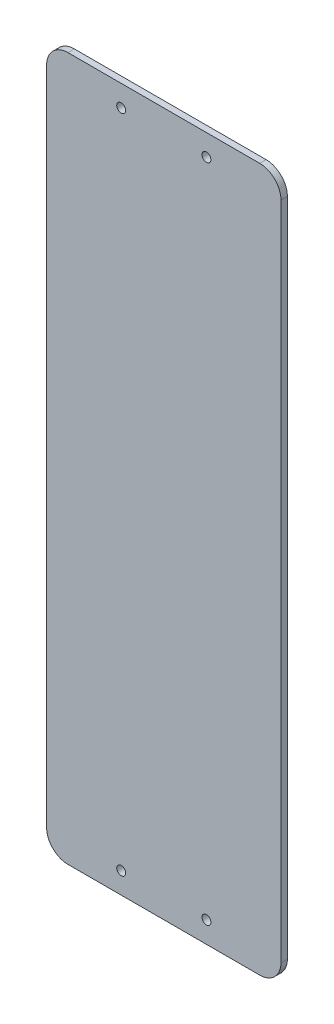
ISO-10303-21;
HEADER;
FILE_DESCRIPTION(('STEP AP214'),'2;1');
FILE_NAME('part.step','',(''),(''),'','','');
FILE_SCHEMA(('AUTOMOTIVE_DESIGN { 1 0 10303 214 1 1 1 1 }'));
ENDSEC;
DATA;
#1=APPLICATION_CONTEXT('core data for automotive mechanical design processes');
#2=APPLICATION_PROTOCOL_DEFINITION('international standard','automotive_design',2000,#1);
#3=PRODUCT_CONTEXT('',#1,'mechanical');
#4=PRODUCT('Part','Part','',(#3));
#5=PRODUCT_RELATED_PRODUCT_CATEGORY('part','',(#4));
#6=PRODUCT_DEFINITION_FORMATION('','',#4);
#7=PRODUCT_DEFINITION_CONTEXT('part definition',#1,'design');
#8=PRODUCT_DEFINITION('design','',#6,#7);
#9=PRODUCT_DEFINITION_SHAPE('','',#8);
#10=(LENGTH_UNIT() NAMED_UNIT(*) SI_UNIT(.MILLI.,.METRE.));
#11=(NAMED_UNIT(*) PLANE_ANGLE_UNIT() SI_UNIT($,.RADIAN.));
#12=(NAMED_UNIT(*) SI_UNIT($,.STERADIAN.) SOLID_ANGLE_UNIT());
#13=UNCERTAINTY_MEASURE_WITH_UNIT(LENGTH_MEASURE(1.E-05),#10,'distance_accuracy_value','');
#14=(GEOMETRIC_REPRESENTATION_CONTEXT(3) GLOBAL_UNCERTAINTY_ASSIGNED_CONTEXT((#13)) GLOBAL_UNIT_ASSIGNED_CONTEXT((#10,
#11,#12)) REPRESENTATION_CONTEXT('',''));
#15=CARTESIAN_POINT('',(0.,0.,0.));
#16=DIRECTION('',(0.,0.,1.));
#17=DIRECTION('',(1.,0.,0.));
#18=AXIS2_PLACEMENT_3D('',#15,#16,#17);
#19=CARTESIAN_POINT('',(0.,0.,3.));
#20=DIRECTION('',(0.,0.,-1.));
#21=DIRECTION('',(-1.,0.,0.));
#22=AXIS2_PLACEMENT_3D('',#19,#20,#21);
#23=PLANE('',#22);
#24=DIRECTION('',(-1.,0.,0.));
#25=VECTOR('',#24,1.);
#26=CARTESIAN_POINT('',(0.,330.,3.));
#27=LINE('',#26,#25);
#28=CARTESIAN_POINT('',(100.,330.,3.));
#29=VERTEX_POINT('',#28);
#30=CARTESIAN_POINT('',(10.,330.,3.));
#31=VERTEX_POINT('',#30);
#32=EDGE_CURVE('E143',#29,#31,#27,.T.);
#33=ORIENTED_EDGE('',*,*,#32,.T.);
#34=CARTESIAN_POINT('',(10.,320.,3.));
#35=DIRECTION('',(0.,0.,-1.));
#36=DIRECTION('',(-1.,0.,0.));
#37=AXIS2_PLACEMENT_3D('',#34,#35,#36);
#38=CIRCLE('',#37,10.);
#39=CARTESIAN_POINT('',(0.,320.,3.));
#40=VERTEX_POINT('',#39);
#41=EDGE_CURVE('E166',#31,#40,#38,.F.);
#42=ORIENTED_EDGE('',*,*,#41,.T.);
#43=DIRECTION('',(0.,-1.,0.));
#44=VECTOR('',#43,1.);
#45=CARTESIAN_POINT('',(0.,0.,3.));
#46=LINE('',#45,#44);
#47=CARTESIAN_POINT('',(0.,10.,3.));
#48=VERTEX_POINT('',#47);
#49=EDGE_CURVE('E125',#40,#48,#46,.T.);
#50=ORIENTED_EDGE('',*,*,#49,.T.);
#51=CARTESIAN_POINT('',(10.,10.,3.));
#52=DIRECTION('',(0.,0.,-1.));
#53=DIRECTION('',(-1.,0.,0.));
#54=AXIS2_PLACEMENT_3D('',#51,#52,#53);
#55=CIRCLE('',#54,10.);
#56=CARTESIAN_POINT('',(10.,0.,3.));
#57=VERTEX_POINT('',#56);
#58=EDGE_CURVE('E163',#48,#57,#55,.F.);
#59=ORIENTED_EDGE('',*,*,#58,.T.);
#60=DIRECTION('',(1.,0.,0.));
#61=VECTOR('',#60,1.);
#62=CARTESIAN_POINT('',(0.,0.,3.));
#63=LINE('',#62,#61);
#64=CARTESIAN_POINT('',(100.,0.,3.));
#65=VERTEX_POINT('',#64);
#66=EDGE_CURVE('E189',#57,#65,#63,.T.);
#67=ORIENTED_EDGE('',*,*,#66,.T.);
#68=CARTESIAN_POINT('',(100.,10.,3.));
#69=DIRECTION('',(0.,0.,-1.));
#70=DIRECTION('',(-1.,0.,0.));
#71=AXIS2_PLACEMENT_3D('',#68,#69,#70);
#72=CIRCLE('',#71,10.);
#73=CARTESIAN_POINT('',(110.,10.,3.));
#74=VERTEX_POINT('',#73);
#75=EDGE_CURVE('E60',#65,#74,#72,.F.);
#76=ORIENTED_EDGE('',*,*,#75,.T.);
#77=DIRECTION('',(0.,1.,0.));
#78=VECTOR('',#77,1.);
#79=CARTESIAN_POINT('',(110.,0.,3.));
#80=LINE('',#79,#78);
#81=CARTESIAN_POINT('',(110.,320.,3.));
#82=VERTEX_POINT('',#81);
#83=EDGE_CURVE('E177',#74,#82,#80,.T.);
#84=ORIENTED_EDGE('',*,*,#83,.T.);
#85=CARTESIAN_POINT('',(100.,320.,3.));
#86=DIRECTION('',(0.,0.,-1.));
#87=DIRECTION('',(-1.,0.,0.));
#88=AXIS2_PLACEMENT_3D('',#85,#86,#87);
#89=CIRCLE('',#88,10.);
#90=EDGE_CURVE('E160',#82,#29,#89,.F.);
#91=ORIENTED_EDGE('',*,*,#90,.T.);
#92=EDGE_LOOP('',(#33,#42,#50,#59,#67,#76,#84,#91));
#93=FACE_BOUND('',#92,.T.);
#94=CARTESIAN_POINT('',(35.,320.,3.));
#95=DIRECTION('',(0.,0.,1.));
#96=DIRECTION('',(1.,0.,0.));
#97=AXIS2_PLACEMENT_3D('',#94,#95,#96);
#98=CIRCLE('',#97,2.09999999999999);
#99=CARTESIAN_POINT('',(37.1,320.,3.));
#100=VERTEX_POINT('',#99);
#101=EDGE_CURVE('E133',#100,#100,#98,.T.);
#102=ORIENTED_EDGE('',*,*,#101,.F.);
#103=EDGE_LOOP('',(#102));
#104=FACE_BOUND('',#103,.T.);
#105=CARTESIAN_POINT('',(75.,320.,3.));
#106=DIRECTION('',(0.,0.,1.));
#107=DIRECTION('',(-1.,0.,0.));
#108=AXIS2_PLACEMENT_3D('',#105,#106,#107);
#109=CIRCLE('',#108,2.1);
#110=CARTESIAN_POINT('',(72.9,320.,3.));
#111=VERTEX_POINT('',#110);
#112=EDGE_CURVE('E206',#111,#111,#109,.T.);
#113=ORIENTED_EDGE('',*,*,#112,.F.);
#114=EDGE_LOOP('',(#113));
#115=FACE_BOUND('',#114,.T.);
#116=CARTESIAN_POINT('',(75.,10.,3.));
#117=DIRECTION('',(0.,0.,1.));
#118=DIRECTION('',(1.,0.,0.));
#119=AXIS2_PLACEMENT_3D('',#116,#117,#118);
#120=CIRCLE('',#119,2.1);
#121=CARTESIAN_POINT('',(77.1,10.,3.));
#122=VERTEX_POINT('',#121);
#123=EDGE_CURVE('E349',#122,#122,#120,.T.);
#124=ORIENTED_EDGE('',*,*,#123,.F.);
#125=EDGE_LOOP('',(#124));
#126=FACE_BOUND('',#125,.T.);
#127=CARTESIAN_POINT('',(35.,10.,3.));
#128=DIRECTION('',(0.,0.,1.));
#129=DIRECTION('',(-1.,0.,0.));
#130=AXIS2_PLACEMENT_3D('',#127,#128,#129);
#131=CIRCLE('',#130,2.1);
#132=CARTESIAN_POINT('',(32.9,10.,3.));
#133=VERTEX_POINT('',#132);
#134=EDGE_CURVE('E352',#133,#133,#131,.T.);
#135=ORIENTED_EDGE('',*,*,#134,.F.);
#136=EDGE_LOOP('',(#135));
#137=FACE_BOUND('',#136,.T.);
#138=ADVANCED_FACE('F40',(#93,#104,#115,#126,#137),#23,.F.);
#139=CARTESIAN_POINT('',(0.,0.,0.));
#140=DIRECTION('',(0.,0.,-1.));
#141=DIRECTION('',(-1.,0.,0.));
#142=AXIS2_PLACEMENT_3D('',#139,#140,#141);
#143=PLANE('',#142);
#144=CARTESIAN_POINT('',(75.,10.,0.));
#145=DIRECTION('',(0.,0.,1.));
#146=DIRECTION('',(1.,0.,0.));
#147=AXIS2_PLACEMENT_3D('',#144,#145,#146);
#148=CIRCLE('',#147,2.1);
#149=CARTESIAN_POINT('',(77.1,10.,0.));
#150=VERTEX_POINT('',#149);
#151=EDGE_CURVE('E354',#150,#150,#148,.T.);
#152=ORIENTED_EDGE('',*,*,#151,.T.);
#153=EDGE_LOOP('',(#152));
#154=FACE_BOUND('',#153,.T.);
#155=CARTESIAN_POINT('',(35.,320.,0.));
#156=DIRECTION('',(0.,0.,1.));
#157=DIRECTION('',(1.,0.,0.));
#158=AXIS2_PLACEMENT_3D('',#155,#156,#157);
#159=CIRCLE('',#158,2.09999999999999);
#160=CARTESIAN_POINT('',(37.1,320.,0.));
#161=VERTEX_POINT('',#160);
#162=EDGE_CURVE('E140',#161,#161,#159,.T.);
#163=ORIENTED_EDGE('',*,*,#162,.T.);
#164=EDGE_LOOP('',(#163));
#165=FACE_BOUND('',#164,.T.);
#166=DIRECTION('',(0.,-1.,0.));
#167=VECTOR('',#166,1.);
#168=CARTESIAN_POINT('',(0.,0.,0.));
#169=LINE('',#168,#167);
#170=CARTESIAN_POINT('',(0.,320.,0.));
#171=VERTEX_POINT('',#170);
#172=CARTESIAN_POINT('',(0.,10.,0.));
#173=VERTEX_POINT('',#172);
#174=EDGE_CURVE('E122',#171,#173,#169,.T.);
#175=ORIENTED_EDGE('',*,*,#174,.F.);
#176=CARTESIAN_POINT('',(10.,320.,0.));
#177=DIRECTION('',(0.,0.,-1.));
#178=DIRECTION('',(-1.,0.,0.));
#179=AXIS2_PLACEMENT_3D('',#176,#177,#178);
#180=CIRCLE('',#179,10.);
#181=CARTESIAN_POINT('',(10.,330.,0.));
#182=VERTEX_POINT('',#181);
#183=EDGE_CURVE('E105',#171,#182,#180,.T.);
#184=ORIENTED_EDGE('',*,*,#183,.T.);
#185=DIRECTION('',(-1.,0.,0.));
#186=VECTOR('',#185,1.);
#187=CARTESIAN_POINT('',(0.,330.,0.));
#188=LINE('',#187,#186);
#189=CARTESIAN_POINT('',(100.,330.,0.));
#190=VERTEX_POINT('',#189);
#191=EDGE_CURVE('E148',#190,#182,#188,.T.);
#192=ORIENTED_EDGE('',*,*,#191,.F.);
#193=CARTESIAN_POINT('',(100.,320.,0.));
#194=DIRECTION('',(0.,0.,-1.));
#195=DIRECTION('',(-1.,0.,0.));
#196=AXIS2_PLACEMENT_3D('',#193,#194,#195);
#197=CIRCLE('',#196,10.);
#198=CARTESIAN_POINT('',(110.,320.,0.));
#199=VERTEX_POINT('',#198);
#200=EDGE_CURVE('E152',#190,#199,#197,.T.);
#201=ORIENTED_EDGE('',*,*,#200,.T.);
#202=DIRECTION('',(0.,1.,0.));
#203=VECTOR('',#202,1.);
#204=CARTESIAN_POINT('',(110.,0.,0.));
#205=LINE('',#204,#203);
#206=CARTESIAN_POINT('',(110.,10.,0.));
#207=VERTEX_POINT('',#206);
#208=EDGE_CURVE('E136',#207,#199,#205,.T.);
#209=ORIENTED_EDGE('',*,*,#208,.F.);
#210=CARTESIAN_POINT('',(100.,10.,0.));
#211=DIRECTION('',(0.,0.,-1.));
#212=DIRECTION('',(-1.,0.,0.));
#213=AXIS2_PLACEMENT_3D('',#210,#211,#212);
#214=CIRCLE('',#213,10.);
#215=CARTESIAN_POINT('',(100.,0.,0.));
#216=VERTEX_POINT('',#215);
#217=EDGE_CURVE('E126',#207,#216,#214,.T.);
#218=ORIENTED_EDGE('',*,*,#217,.T.);
#219=DIRECTION('',(1.,0.,0.));
#220=VECTOR('',#219,1.);
#221=CARTESIAN_POINT('',(0.,0.,0.));
#222=LINE('',#221,#220);
#223=CARTESIAN_POINT('',(10.,0.,0.));
#224=VERTEX_POINT('',#223);
#225=EDGE_CURVE('E132',#224,#216,#222,.T.);
#226=ORIENTED_EDGE('',*,*,#225,.F.);
#227=CARTESIAN_POINT('',(10.,10.,0.));
#228=DIRECTION('',(0.,0.,-1.));
#229=DIRECTION('',(-1.,0.,0.));
#230=AXIS2_PLACEMENT_3D('',#227,#228,#229);
#231=CIRCLE('',#230,10.);
#232=EDGE_CURVE('E116',#224,#173,#231,.T.);
#233=ORIENTED_EDGE('',*,*,#232,.T.);
#234=EDGE_LOOP('',(#175,#184,#192,#201,#209,#218,#226,#233));
#235=FACE_BOUND('',#234,.T.);
#236=CARTESIAN_POINT('',(75.,320.,0.));
#237=DIRECTION('',(0.,0.,1.));
#238=DIRECTION('',(-1.,0.,0.));
#239=AXIS2_PLACEMENT_3D('',#236,#237,#238);
#240=CIRCLE('',#239,2.1);
#241=CARTESIAN_POINT('',(72.9,320.,0.));
#242=VERTEX_POINT('',#241);
#243=EDGE_CURVE('E204',#242,#242,#240,.T.);
#244=ORIENTED_EDGE('',*,*,#243,.T.);
#245=EDGE_LOOP('',(#244));
#246=FACE_BOUND('',#245,.T.);
#247=CARTESIAN_POINT('',(35.,10.,0.));
#248=DIRECTION('',(0.,0.,1.));
#249=DIRECTION('',(-1.,0.,0.));
#250=AXIS2_PLACEMENT_3D('',#247,#248,#249);
#251=CIRCLE('',#250,2.1);
#252=CARTESIAN_POINT('',(32.9,10.,0.));
#253=VERTEX_POINT('',#252);
#254=EDGE_CURVE('E355',#253,#253,#251,.T.);
#255=ORIENTED_EDGE('',*,*,#254,.T.);
#256=EDGE_LOOP('',(#255));
#257=FACE_BOUND('',#256,.T.);
#258=ADVANCED_FACE('F129',(#154,#165,#235,#246,#257),#143,.T.);
#259=CARTESIAN_POINT('',(0.,0.,3.));
#260=DIRECTION('',(1.,0.,0.));
#261=DIRECTION('',(0.,0.,-1.));
#262=AXIS2_PLACEMENT_3D('',#259,#260,#261);
#263=PLANE('',#262);
#264=ORIENTED_EDGE('',*,*,#49,.F.);
#265=DIRECTION('',(0.,0.,-1.));
#266=VECTOR('',#265,1.);
#267=CARTESIAN_POINT('',(0.,320.,3.));
#268=LINE('',#267,#266);
#269=EDGE_CURVE('E109',#40,#171,#268,.T.);
#270=ORIENTED_EDGE('',*,*,#269,.T.);
#271=ORIENTED_EDGE('',*,*,#174,.T.);
#272=DIRECTION('',(0.,0.,-1.));
#273=VECTOR('',#272,1.);
#274=CARTESIAN_POINT('',(0.,10.,3.));
#275=LINE('',#274,#273);
#276=EDGE_CURVE('E127',#173,#48,#275,.F.);
#277=ORIENTED_EDGE('',*,*,#276,.T.);
#278=EDGE_LOOP('',(#264,#270,#271,#277));
#279=FACE_BOUND('',#278,.T.);
#280=ADVANCED_FACE('F121',(#279),#263,.F.);
#281=CARTESIAN_POINT('',(0.,0.,3.));
#282=DIRECTION('',(0.,1.,0.));
#283=DIRECTION('',(0.,0.,1.));
#284=AXIS2_PLACEMENT_3D('',#281,#282,#283);
#285=PLANE('',#284);
#286=ORIENTED_EDGE('',*,*,#66,.F.);
#287=DIRECTION('',(0.,0.,-1.));
#288=VECTOR('',#287,1.);
#289=CARTESIAN_POINT('',(10.,0.,3.));
#290=LINE('',#289,#288);
#291=EDGE_CURVE('E171',#57,#224,#290,.T.);
#292=ORIENTED_EDGE('',*,*,#291,.T.);
#293=ORIENTED_EDGE('',*,*,#225,.T.);
#294=DIRECTION('',(0.,0.,-1.));
#295=VECTOR('',#294,1.);
#296=CARTESIAN_POINT('',(100.,0.,3.));
#297=LINE('',#296,#295);
#298=EDGE_CURVE('E169',#216,#65,#297,.F.);
#299=ORIENTED_EDGE('',*,*,#298,.T.);
#300=EDGE_LOOP('',(#286,#292,#293,#299));
#301=FACE_BOUND('',#300,.T.);
#302=ADVANCED_FACE('F217',(#301),#285,.F.);
#303=CARTESIAN_POINT('',(110.,0.,3.));
#304=DIRECTION('',(-1.,0.,0.));
#305=DIRECTION('',(0.,0.,1.));
#306=AXIS2_PLACEMENT_3D('',#303,#304,#305);
#307=PLANE('',#306);
#308=ORIENTED_EDGE('',*,*,#208,.T.);
#309=DIRECTION('',(0.,0.,-1.));
#310=VECTOR('',#309,1.);
#311=CARTESIAN_POINT('',(110.,320.,3.));
#312=LINE('',#311,#310);
#313=EDGE_CURVE('E12',#199,#82,#312,.F.);
#314=ORIENTED_EDGE('',*,*,#313,.T.);
#315=ORIENTED_EDGE('',*,*,#83,.F.);
#316=DIRECTION('',(0.,0.,-1.));
#317=VECTOR('',#316,1.);
#318=CARTESIAN_POINT('',(110.,10.,3.));
#319=LINE('',#318,#317);
#320=EDGE_CURVE('E48',#74,#207,#319,.T.);
#321=ORIENTED_EDGE('',*,*,#320,.T.);
#322=EDGE_LOOP('',(#308,#314,#315,#321));
#323=FACE_BOUND('',#322,.T.);
#324=ADVANCED_FACE('F176',(#323),#307,.F.);
#325=CARTESIAN_POINT('',(0.,330.,3.));
#326=DIRECTION('',(0.,-1.,0.));
#327=DIRECTION('',(0.,0.,-1.));
#328=AXIS2_PLACEMENT_3D('',#325,#326,#327);
#329=PLANE('',#328);
#330=ORIENTED_EDGE('',*,*,#191,.T.);
#331=DIRECTION('',(0.,0.,-1.));
#332=VECTOR('',#331,1.);
#333=CARTESIAN_POINT('',(10.,330.,3.));
#334=LINE('',#333,#332);
#335=EDGE_CURVE('E110',#182,#31,#334,.F.);
#336=ORIENTED_EDGE('',*,*,#335,.T.);
#337=ORIENTED_EDGE('',*,*,#32,.F.);
#338=DIRECTION('',(0.,0.,-1.));
#339=VECTOR('',#338,1.);
#340=CARTESIAN_POINT('',(100.,330.,3.));
#341=LINE('',#340,#339);
#342=EDGE_CURVE('E115',#29,#190,#341,.T.);
#343=ORIENTED_EDGE('',*,*,#342,.T.);
#344=EDGE_LOOP('',(#330,#336,#337,#343));
#345=FACE_BOUND('',#344,.T.);
#346=ADVANCED_FACE('F185',(#345),#329,.F.);
#347=CARTESIAN_POINT('',(35.,320.,3.));
#348=DIRECTION('',(0.,0.,-1.));
#349=DIRECTION('',(-1.,0.,0.));
#350=AXIS2_PLACEMENT_3D('',#347,#348,#349);
#351=CYLINDRICAL_SURFACE('',#350,2.09999999999999);
#352=ORIENTED_EDGE('',*,*,#101,.T.);
#353=EDGE_LOOP('',(#352));
#354=FACE_BOUND('',#353,.T.);
#355=ORIENTED_EDGE('',*,*,#162,.F.);
#356=EDGE_LOOP('',(#355));
#357=FACE_BOUND('',#356,.T.);
#358=ADVANCED_FACE('F231',(#354,#357),#351,.F.);
#359=CARTESIAN_POINT('',(75.,320.,3.));
#360=DIRECTION('',(0.,0.,-1.));
#361=DIRECTION('',(-1.,0.,0.));
#362=AXIS2_PLACEMENT_3D('',#359,#360,#361);
#363=CYLINDRICAL_SURFACE('',#362,2.1);
#364=ORIENTED_EDGE('',*,*,#112,.T.);
#365=EDGE_LOOP('',(#364));
#366=FACE_BOUND('',#365,.T.);
#367=ORIENTED_EDGE('',*,*,#243,.F.);
#368=EDGE_LOOP('',(#367));
#369=FACE_BOUND('',#368,.T.);
#370=ADVANCED_FACE('F284',(#366,#369),#363,.F.);
#371=CARTESIAN_POINT('',(75.,10.,3.));
#372=DIRECTION('',(0.,0.,-1.));
#373=DIRECTION('',(-1.,0.,0.));
#374=AXIS2_PLACEMENT_3D('',#371,#372,#373);
#375=CYLINDRICAL_SURFACE('',#374,2.1);
#376=ORIENTED_EDGE('',*,*,#123,.T.);
#377=EDGE_LOOP('',(#376));
#378=FACE_BOUND('',#377,.T.);
#379=ORIENTED_EDGE('',*,*,#151,.F.);
#380=EDGE_LOOP('',(#379));
#381=FACE_BOUND('',#380,.T.);
#382=ADVANCED_FACE('F275',(#378,#381),#375,.F.);
#383=CARTESIAN_POINT('',(35.,10.,3.));
#384=DIRECTION('',(0.,0.,-1.));
#385=DIRECTION('',(-1.,0.,0.));
#386=AXIS2_PLACEMENT_3D('',#383,#384,#385);
#387=CYLINDRICAL_SURFACE('',#386,2.1);
#388=ORIENTED_EDGE('',*,*,#134,.T.);
#389=EDGE_LOOP('',(#388));
#390=FACE_BOUND('',#389,.T.);
#391=ORIENTED_EDGE('',*,*,#254,.F.);
#392=EDGE_LOOP('',(#391));
#393=FACE_BOUND('',#392,.T.);
#394=ADVANCED_FACE('F244',(#390,#393),#387,.F.);
#395=CARTESIAN_POINT('',(10.,320.,3.));
#396=DIRECTION('',(0.,0.,-1.));
#397=DIRECTION('',(-1.,0.,0.));
#398=AXIS2_PLACEMENT_3D('',#395,#396,#397);
#399=CYLINDRICAL_SURFACE('',#398,10.);
#400=ORIENTED_EDGE('',*,*,#41,.F.);
#401=ORIENTED_EDGE('',*,*,#335,.F.);
#402=ORIENTED_EDGE('',*,*,#183,.F.);
#403=ORIENTED_EDGE('',*,*,#269,.F.);
#404=EDGE_LOOP('',(#400,#401,#402,#403));
#405=FACE_BOUND('',#404,.T.);
#406=ADVANCED_FACE('F108',(#405),#399,.T.);
#407=CARTESIAN_POINT('',(10.,10.,3.));
#408=DIRECTION('',(0.,0.,-1.));
#409=DIRECTION('',(-1.,0.,0.));
#410=AXIS2_PLACEMENT_3D('',#407,#408,#409);
#411=CYLINDRICAL_SURFACE('',#410,10.);
#412=ORIENTED_EDGE('',*,*,#58,.F.);
#413=ORIENTED_EDGE('',*,*,#276,.F.);
#414=ORIENTED_EDGE('',*,*,#232,.F.);
#415=ORIENTED_EDGE('',*,*,#291,.F.);
#416=EDGE_LOOP('',(#412,#413,#414,#415));
#417=FACE_BOUND('',#416,.T.);
#418=ADVANCED_FACE('F215',(#417),#411,.T.);
#419=CARTESIAN_POINT('',(100.,320.,3.));
#420=DIRECTION('',(0.,0.,-1.));
#421=DIRECTION('',(-1.,0.,0.));
#422=AXIS2_PLACEMENT_3D('',#419,#420,#421);
#423=CYLINDRICAL_SURFACE('',#422,10.);
#424=ORIENTED_EDGE('',*,*,#90,.F.);
#425=ORIENTED_EDGE('',*,*,#313,.F.);
#426=ORIENTED_EDGE('',*,*,#200,.F.);
#427=ORIENTED_EDGE('',*,*,#342,.F.);
#428=EDGE_LOOP('',(#424,#425,#426,#427));
#429=FACE_BOUND('',#428,.T.);
#430=ADVANCED_FACE('F182',(#429),#423,.T.);
#431=CARTESIAN_POINT('',(100.,10.,3.));
#432=DIRECTION('',(0.,0.,-1.));
#433=DIRECTION('',(-1.,0.,0.));
#434=AXIS2_PLACEMENT_3D('',#431,#432,#433);
#435=CYLINDRICAL_SURFACE('',#434,10.);
#436=ORIENTED_EDGE('',*,*,#75,.F.);
#437=ORIENTED_EDGE('',*,*,#298,.F.);
#438=ORIENTED_EDGE('',*,*,#217,.F.);
#439=ORIENTED_EDGE('',*,*,#320,.F.);
#440=EDGE_LOOP('',(#436,#437,#438,#439));
#441=FACE_BOUND('',#440,.T.);
#442=ADVANCED_FACE('F42',(#441),#435,.T.);
#443=CLOSED_SHELL('',(#138,#258,#280,#302,#324,#346,#358,#370,#382,#394,#406,#418,#430,#442));
#444=MANIFOLD_SOLID_BREP('B2',#443);
#445=ADVANCED_BREP_SHAPE_REPRESENTATION('',(#18,#444),#14);
#446=SHAPE_DEFINITION_REPRESENTATION(#9,#445);
ENDSEC;
END-ISO-10303-21;
